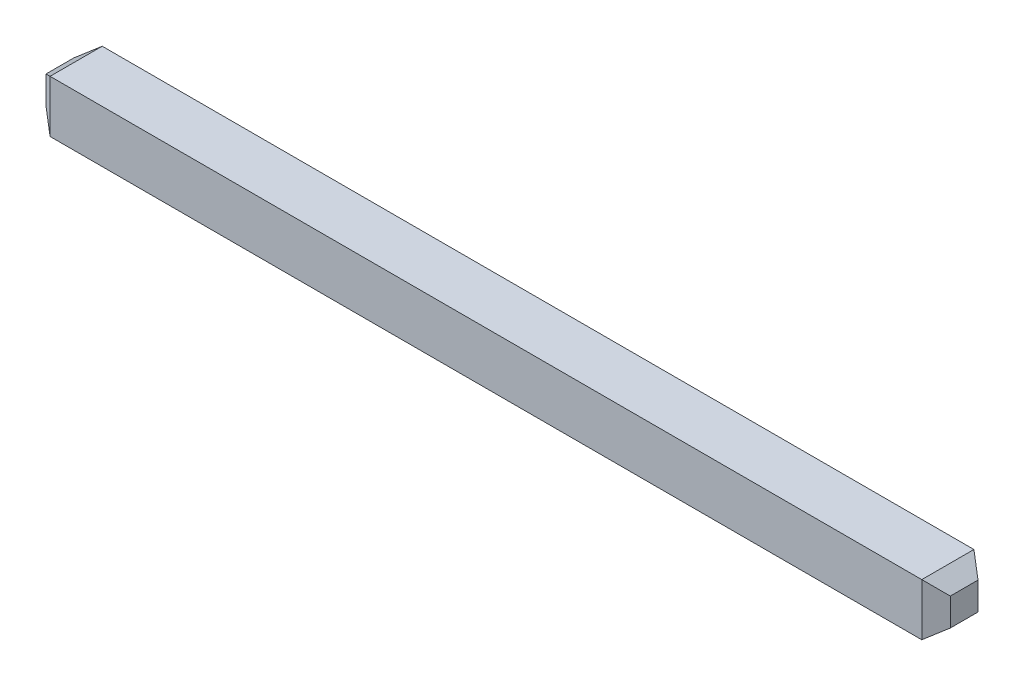
ISO-10303-21;
HEADER;
FILE_DESCRIPTION(('STEP AP214'),'2;1');
FILE_NAME('part.step','',(''),(''),'','','');
FILE_SCHEMA(('AUTOMOTIVE_DESIGN { 1 0 10303 214 1 1 1 1 }'));
ENDSEC;
DATA;
#1=APPLICATION_CONTEXT('core data for automotive mechanical design processes');
#2=APPLICATION_PROTOCOL_DEFINITION('international standard','automotive_design',2000,#1);
#3=PRODUCT_CONTEXT('',#1,'mechanical');
#4=PRODUCT('Part','Part','',(#3));
#5=PRODUCT_RELATED_PRODUCT_CATEGORY('part','',(#4));
#6=PRODUCT_DEFINITION_FORMATION('','',#4);
#7=PRODUCT_DEFINITION_CONTEXT('part definition',#1,'design');
#8=PRODUCT_DEFINITION('design','',#6,#7);
#9=PRODUCT_DEFINITION_SHAPE('','',#8);
#10=(LENGTH_UNIT() NAMED_UNIT(*) SI_UNIT(.MILLI.,.METRE.));
#11=(NAMED_UNIT(*) PLANE_ANGLE_UNIT() SI_UNIT($,.RADIAN.));
#12=(NAMED_UNIT(*) SI_UNIT($,.STERADIAN.) SOLID_ANGLE_UNIT());
#13=UNCERTAINTY_MEASURE_WITH_UNIT(LENGTH_MEASURE(1.E-05),#10,'distance_accuracy_value','');
#14=(GEOMETRIC_REPRESENTATION_CONTEXT(3) GLOBAL_UNCERTAINTY_ASSIGNED_CONTEXT((#13)) GLOBAL_UNIT_ASSIGNED_CONTEXT((#10,
#11,#12)) REPRESENTATION_CONTEXT('',''));
#15=CARTESIAN_POINT('',(0.,0.,0.));
#16=DIRECTION('',(0.,0.,1.));
#17=DIRECTION('',(1.,0.,0.));
#18=AXIS2_PLACEMENT_3D('',#15,#16,#17);
#19=CARTESIAN_POINT('',(-2.4,1.23,-16.755));
#20=DIRECTION('',(0.5999999999908,0.,0.8000000000069));
#21=DIRECTION('',(0.8000000000069,0.,-0.5999999999908));
#22=AXIS2_PLACEMENT_3D('',#19,#20,#21);
#23=PLANE('',#22);
#24=DIRECTION('',(0.,1.,0.));
#25=VECTOR('',#24,1.);
#26=CARTESIAN_POINT('',(-2.3,1.23,-16.83));
#27=LINE('',#26,#25);
#28=CARTESIAN_POINT('',(-2.29999999999957,1.55,-16.8299999999994));
#29=VERTEX_POINT('',#28);
#30=CARTESIAN_POINT('',(-2.29999999999958,0.909999999999898,-16.8299999999994));
#31=VERTEX_POINT('',#30);
#32=EDGE_CURVE('E101',#29,#31,#27,.F.);
#33=ORIENTED_EDGE('',*,*,#32,.T.);
#34=DIRECTION('',(-0.685994340569495,0.514495755428344,0.514495755427429));
#35=VECTOR('',#34,1.);
#36=CARTESIAN_POINT('',(-2.30000000000009,0.909999999999786,-16.83));
#37=LINE('',#36,#35);
#38=CARTESIAN_POINT('',(-2.50000000000021,1.06000000000001,-16.6800000000003));
#39=VERTEX_POINT('',#38);
#40=EDGE_CURVE('E85',#31,#39,#37,.T.);
#41=ORIENTED_EDGE('',*,*,#40,.T.);
#42=DIRECTION('',(0.,1.,0.));
#43=VECTOR('',#42,1.);
#44=CARTESIAN_POINT('',(-2.5,1.23,-16.68));
#45=LINE('',#44,#43);
#46=CARTESIAN_POINT('',(-2.50000000000043,1.4,-16.6800000000006));
#47=VERTEX_POINT('',#46);
#48=EDGE_CURVE('E79',#39,#47,#45,.T.);
#49=ORIENTED_EDGE('',*,*,#48,.T.);
#50=DIRECTION('',(-0.685994340570038,-0.514495755427529,0.51449575542752));
#51=VECTOR('',#50,1.);
#52=CARTESIAN_POINT('',(-2.3,1.55,-16.83));
#53=LINE('',#52,#51);
#54=EDGE_CURVE('E20',#29,#47,#53,.T.);
#55=ORIENTED_EDGE('',*,*,#54,.F.);
#56=EDGE_LOOP('',(#33,#41,#49,#55));
#57=FACE_BOUND('',#56,.T.);
#58=ADVANCED_FACE('F17',(#57),#23,.F.);
#59=CARTESIAN_POINT('',(8.5,1.23,-16.755));
#60=DIRECTION('',(-0.5999999999908,0.,0.8000000000069));
#61=DIRECTION('',(0.8000000000069,0.,0.5999999999908));
#62=AXIS2_PLACEMENT_3D('',#59,#60,#61);
#63=PLANE('',#62);
#64=DIRECTION('',(0.,1.,0.));
#65=VECTOR('',#64,1.);
#66=CARTESIAN_POINT('',(8.6,1.23,-16.68));
#67=LINE('',#66,#65);
#68=CARTESIAN_POINT('',(8.6000000000002,1.06000000000003,-16.6800000000003));
#69=VERTEX_POINT('',#68);
#70=CARTESIAN_POINT('',(8.60000000000043,1.4,-16.6800000000006));
#71=VERTEX_POINT('',#70);
#72=EDGE_CURVE('E113',#69,#71,#67,.T.);
#73=ORIENTED_EDGE('',*,*,#72,.F.);
#74=DIRECTION('',(-0.685994340569496,-0.514495755428343,-0.514495755427429));
#75=VECTOR('',#74,1.);
#76=CARTESIAN_POINT('',(8.59999999999996,1.06000000000005,-16.68));
#77=LINE('',#76,#75);
#78=CARTESIAN_POINT('',(8.39999999999959,0.909999999999884,-16.8299999999994));
#79=VERTEX_POINT('',#78);
#80=EDGE_CURVE('E108',#69,#79,#77,.T.);
#81=ORIENTED_EDGE('',*,*,#80,.T.);
#82=DIRECTION('',(0.,1.,0.));
#83=VECTOR('',#82,1.);
#84=CARTESIAN_POINT('',(8.4,1.23,-16.83));
#85=LINE('',#84,#83);
#86=CARTESIAN_POINT('',(8.39999999999957,1.55,-16.8299999999994));
#87=VERTEX_POINT('',#86);
#88=EDGE_CURVE('E99',#79,#87,#85,.T.);
#89=ORIENTED_EDGE('',*,*,#88,.T.);
#90=DIRECTION('',(-0.685994340570037,0.514495755427528,-0.514495755427522));
#91=VECTOR('',#90,1.);
#92=CARTESIAN_POINT('',(8.6,1.4,-16.68));
#93=LINE('',#92,#91);
#94=EDGE_CURVE('E116',#71,#87,#93,.T.);
#95=ORIENTED_EDGE('',*,*,#94,.F.);
#96=EDGE_LOOP('',(#73,#81,#89,#95));
#97=FACE_BOUND('',#96,.T.);
#98=ADVANCED_FACE('F214',(#97),#63,.F.);
#99=CARTESIAN_POINT('',(-2.4,1.475,-16.51));
#100=DIRECTION('',(-0.6,0.8,0.));
#101=DIRECTION('',(-0.8,-0.6,0.));
#102=AXIS2_PLACEMENT_3D('',#99,#100,#101);
#103=PLANE('',#102);
#104=DIRECTION('',(-0.685994340575992,-0.514495755427529,-0.514495755419582));
#105=VECTOR('',#104,1.);
#106=CARTESIAN_POINT('',(-2.29999999999913,1.55,-16.1900000000012));
#107=LINE('',#106,#105);
#108=CARTESIAN_POINT('',(-2.29999999999989,1.55,-16.1900000000001));
#109=VERTEX_POINT('',#108);
#110=CARTESIAN_POINT('',(-2.50000000000022,1.4,-16.3399999999997));
#111=VERTEX_POINT('',#110);
#112=EDGE_CURVE('E128',#109,#111,#107,.T.);
#113=ORIENTED_EDGE('',*,*,#112,.F.);
#114=DIRECTION('',(0.,0.,1.));
#115=VECTOR('',#114,1.);
#116=CARTESIAN_POINT('',(-2.3,1.55,-16.51));
#117=LINE('',#116,#115);
#118=EDGE_CURVE('E93',#29,#109,#117,.T.);
#119=ORIENTED_EDGE('',*,*,#118,.F.);
#120=ORIENTED_EDGE('',*,*,#54,.T.);
#121=DIRECTION('',(0.,0.,-1.));
#122=VECTOR('',#121,1.);
#123=CARTESIAN_POINT('',(-2.5,1.4,-16.51));
#124=LINE('',#123,#122);
#125=EDGE_CURVE('E87',#47,#111,#124,.F.);
#126=ORIENTED_EDGE('',*,*,#125,.T.);
#127=EDGE_LOOP('',(#113,#119,#120,#126));
#128=FACE_BOUND('',#127,.T.);
#129=ADVANCED_FACE('F90',(#128),#103,.T.);
#130=CARTESIAN_POINT('',(-2.5,1.23,-16.51));
#131=DIRECTION('',(1.,0.,0.));
#132=DIRECTION('',(0.,0.,-1.));
#133=AXIS2_PLACEMENT_3D('',#130,#131,#132);
#134=PLANE('',#133);
#135=DIRECTION('',(0.,1.,0.));
#136=VECTOR('',#135,1.);
#137=CARTESIAN_POINT('',(-2.50000000000087,1.23,-16.3399999999988));
#138=LINE('',#137,#136);
#139=CARTESIAN_POINT('',(-2.50000000000021,1.06000000000001,-16.3399999999997));
#140=VERTEX_POINT('',#139);
#141=EDGE_CURVE('E97',#111,#140,#138,.F.);
#142=ORIENTED_EDGE('',*,*,#141,.F.);
#143=ORIENTED_EDGE('',*,*,#125,.F.);
#144=ORIENTED_EDGE('',*,*,#48,.F.);
#145=DIRECTION('',(0.,0.,1.));
#146=VECTOR('',#145,1.);
#147=CARTESIAN_POINT('',(-2.49999999999996,1.06000000000005,-16.51));
#148=LINE('',#147,#146);
#149=EDGE_CURVE('E105',#39,#140,#148,.T.);
#150=ORIENTED_EDGE('',*,*,#149,.T.);
#151=EDGE_LOOP('',(#142,#143,#144,#150));
#152=FACE_BOUND('',#151,.T.);
#153=ADVANCED_FACE('F95',(#152),#134,.F.);
#154=CARTESIAN_POINT('',(3.05,1.23,-16.83));
#155=DIRECTION('',(0.,0.,1.));
#156=DIRECTION('',(1.,0.,0.));
#157=AXIS2_PLACEMENT_3D('',#154,#155,#156);
#158=PLANE('',#157);
#159=ORIENTED_EDGE('',*,*,#32,.F.);
#160=DIRECTION('',(1.,0.,0.));
#161=VECTOR('',#160,1.);
#162=CARTESIAN_POINT('',(3.05,1.55,-16.83));
#163=LINE('',#162,#161);
#164=EDGE_CURVE('E122',#87,#29,#163,.F.);
#165=ORIENTED_EDGE('',*,*,#164,.F.);
#166=ORIENTED_EDGE('',*,*,#88,.F.);
#167=DIRECTION('',(1.,0.,0.));
#168=VECTOR('',#167,1.);
#169=CARTESIAN_POINT('',(3.05,0.91,-16.83));
#170=LINE('',#169,#168);
#171=EDGE_CURVE('E136',#79,#31,#170,.F.);
#172=ORIENTED_EDGE('',*,*,#171,.T.);
#173=EDGE_LOOP('',(#159,#165,#166,#172));
#174=FACE_BOUND('',#173,.T.);
#175=ADVANCED_FACE('F182',(#174),#158,.F.);
#176=CARTESIAN_POINT('',(-2.4,0.9849999999999,-16.51));
#177=DIRECTION('',(0.600000000000912,0.799999999999316,0.));
#178=DIRECTION('',(-0.799999999999316,0.600000000000912,0.));
#179=AXIS2_PLACEMENT_3D('',#176,#177,#178);
#180=PLANE('',#179);
#181=DIRECTION('',(0.,0.,1.));
#182=VECTOR('',#181,1.);
#183=CARTESIAN_POINT('',(-2.3,0.91,-16.51));
#184=LINE('',#183,#182);
#185=CARTESIAN_POINT('',(-2.29999999999983,0.909999999999856,-16.1900000000003));
#186=VERTEX_POINT('',#185);
#187=EDGE_CURVE('E139',#31,#186,#184,.T.);
#188=ORIENTED_EDGE('',*,*,#187,.T.);
#189=DIRECTION('',(0.68599434057587,-0.514495755427782,0.514495755419491));
#190=VECTOR('',#189,1.);
#191=CARTESIAN_POINT('',(-2.50000000000087,1.06,-16.3399999999988));
#192=LINE('',#191,#190);
#193=EDGE_CURVE('E131',#140,#186,#192,.T.);
#194=ORIENTED_EDGE('',*,*,#193,.F.);
#195=ORIENTED_EDGE('',*,*,#149,.F.);
#196=ORIENTED_EDGE('',*,*,#40,.F.);
#197=EDGE_LOOP('',(#188,#194,#195,#196));
#198=FACE_BOUND('',#197,.T.);
#199=ADVANCED_FACE('F179',(#198),#180,.F.);
#200=CARTESIAN_POINT('',(8.5,0.9849999999999,-16.51));
#201=DIRECTION('',(-0.600000000000912,0.799999999999316,0.));
#202=DIRECTION('',(-0.799999999999316,-0.600000000000912,0.));
#203=AXIS2_PLACEMENT_3D('',#200,#201,#202);
#204=PLANE('',#203);
#205=DIRECTION('',(0.,0.,-1.));
#206=VECTOR('',#205,1.);
#207=CARTESIAN_POINT('',(8.6,1.06,-16.51));
#208=LINE('',#207,#206);
#209=CARTESIAN_POINT('',(8.6000000000002,1.06000000000003,-16.3399999999997));
#210=VERTEX_POINT('',#209);
#211=EDGE_CURVE('E110',#210,#69,#208,.T.);
#212=ORIENTED_EDGE('',*,*,#211,.F.);
#213=DIRECTION('',(0.685994340575871,0.514495755427787,-0.514495755419485));
#214=VECTOR('',#213,1.);
#215=CARTESIAN_POINT('',(8.39999999999913,0.9099999999999,-16.1900000000012));
#216=LINE('',#215,#214);
#217=CARTESIAN_POINT('',(8.39999999999993,0.909999999999868,-16.1900000000001));
#218=VERTEX_POINT('',#217);
#219=EDGE_CURVE('E35',#218,#210,#216,.T.);
#220=ORIENTED_EDGE('',*,*,#219,.F.);
#221=DIRECTION('',(0.,0.,1.));
#222=VECTOR('',#221,1.);
#223=CARTESIAN_POINT('',(8.4,0.91,-16.51));
#224=LINE('',#223,#222);
#225=EDGE_CURVE('E134',#218,#79,#224,.F.);
#226=ORIENTED_EDGE('',*,*,#225,.T.);
#227=ORIENTED_EDGE('',*,*,#80,.F.);
#228=EDGE_LOOP('',(#212,#220,#226,#227));
#229=FACE_BOUND('',#228,.T.);
#230=ADVANCED_FACE('F181',(#229),#204,.F.);
#231=CARTESIAN_POINT('',(8.6,1.23,-16.51));
#232=DIRECTION('',(1.,0.,0.));
#233=DIRECTION('',(0.,0.,-1.));
#234=AXIS2_PLACEMENT_3D('',#231,#232,#233);
#235=PLANE('',#234);
#236=ORIENTED_EDGE('',*,*,#72,.T.);
#237=DIRECTION('',(0.,0.,1.));
#238=VECTOR('',#237,1.);
#239=CARTESIAN_POINT('',(8.6,1.4,-16.51));
#240=LINE('',#239,#238);
#241=CARTESIAN_POINT('',(8.60000000000022,1.4,-16.3399999999997));
#242=VERTEX_POINT('',#241);
#243=EDGE_CURVE('E119',#242,#71,#240,.F.);
#244=ORIENTED_EDGE('',*,*,#243,.F.);
#245=DIRECTION('',(0.,1.,0.));
#246=VECTOR('',#245,1.);
#247=CARTESIAN_POINT('',(8.60000000000087,1.23,-16.3399999999988));
#248=LINE('',#247,#246);
#249=EDGE_CURVE('E142',#210,#242,#248,.T.);
#250=ORIENTED_EDGE('',*,*,#249,.F.);
#251=ORIENTED_EDGE('',*,*,#211,.T.);
#252=EDGE_LOOP('',(#236,#244,#250,#251));
#253=FACE_BOUND('',#252,.T.);
#254=ADVANCED_FACE('F189',(#253),#235,.T.);
#255=CARTESIAN_POINT('',(8.5,1.475,-16.51));
#256=DIRECTION('',(0.6,0.8,0.));
#257=DIRECTION('',(-0.8,0.6,0.));
#258=AXIS2_PLACEMENT_3D('',#255,#256,#257);
#259=PLANE('',#258);
#260=DIRECTION('',(-0.685994340575992,0.514495755427535,0.514495755419576));
#261=VECTOR('',#260,1.);
#262=CARTESIAN_POINT('',(8.60000000000087,1.4,-16.3399999999988));
#263=LINE('',#262,#261);
#264=CARTESIAN_POINT('',(8.39999999999989,1.55,-16.1900000000001));
#265=VERTEX_POINT('',#264);
#266=EDGE_CURVE('E145',#242,#265,#263,.T.);
#267=ORIENTED_EDGE('',*,*,#266,.F.);
#268=ORIENTED_EDGE('',*,*,#243,.T.);
#269=ORIENTED_EDGE('',*,*,#94,.T.);
#270=DIRECTION('',(0.,0.,1.));
#271=VECTOR('',#270,1.);
#272=CARTESIAN_POINT('',(8.4,1.55,-16.51));
#273=LINE('',#272,#271);
#274=EDGE_CURVE('E125',#265,#87,#273,.F.);
#275=ORIENTED_EDGE('',*,*,#274,.F.);
#276=EDGE_LOOP('',(#267,#268,#269,#275));
#277=FACE_BOUND('',#276,.T.);
#278=ADVANCED_FACE('F170',(#277),#259,.T.);
#279=CARTESIAN_POINT('',(3.05,1.55,-16.51));
#280=DIRECTION('',(0.,1.,0.));
#281=DIRECTION('',(0.,0.,1.));
#282=AXIS2_PLACEMENT_3D('',#279,#280,#281);
#283=PLANE('',#282);
#284=DIRECTION('',(1.,0.,0.));
#285=VECTOR('',#284,1.);
#286=CARTESIAN_POINT('',(3.05,1.55,-16.19));
#287=LINE('',#286,#285);
#288=EDGE_CURVE('E148',#265,#109,#287,.F.);
#289=ORIENTED_EDGE('',*,*,#288,.F.);
#290=ORIENTED_EDGE('',*,*,#274,.T.);
#291=ORIENTED_EDGE('',*,*,#164,.T.);
#292=ORIENTED_EDGE('',*,*,#118,.T.);
#293=EDGE_LOOP('',(#289,#290,#291,#292));
#294=FACE_BOUND('',#293,.T.);
#295=ADVANCED_FACE('F173',(#294),#283,.T.);
#296=CARTESIAN_POINT('',(-2.4,1.23,-16.265));
#297=DIRECTION('',(-0.599999999990736,0.,0.800000000006948));
#298=DIRECTION('',(0.800000000006948,0.,0.599999999990736));
#299=AXIS2_PLACEMENT_3D('',#296,#297,#298);
#300=PLANE('',#299);
#301=ORIENTED_EDGE('',*,*,#193,.T.);
#302=DIRECTION('',(0.,1.,0.));
#303=VECTOR('',#302,1.);
#304=CARTESIAN_POINT('',(-2.3,1.23,-16.19));
#305=LINE('',#304,#303);
#306=EDGE_CURVE('E151',#109,#186,#305,.F.);
#307=ORIENTED_EDGE('',*,*,#306,.F.);
#308=ORIENTED_EDGE('',*,*,#112,.T.);
#309=ORIENTED_EDGE('',*,*,#141,.T.);
#310=EDGE_LOOP('',(#301,#307,#308,#309));
#311=FACE_BOUND('',#310,.T.);
#312=ADVANCED_FACE('F176',(#311),#300,.T.);
#313=CARTESIAN_POINT('',(3.05,0.91,-16.51));
#314=DIRECTION('',(0.,1.,0.));
#315=DIRECTION('',(0.,0.,1.));
#316=AXIS2_PLACEMENT_3D('',#313,#314,#315);
#317=PLANE('',#316);
#318=ORIENTED_EDGE('',*,*,#187,.F.);
#319=ORIENTED_EDGE('',*,*,#171,.F.);
#320=ORIENTED_EDGE('',*,*,#225,.F.);
#321=DIRECTION('',(1.,0.,0.));
#322=VECTOR('',#321,1.);
#323=CARTESIAN_POINT('',(3.05,0.9099999999999,-16.19));
#324=LINE('',#323,#322);
#325=EDGE_CURVE('E26',#186,#218,#324,.T.);
#326=ORIENTED_EDGE('',*,*,#325,.F.);
#327=EDGE_LOOP('',(#318,#319,#320,#326));
#328=FACE_BOUND('',#327,.T.);
#329=ADVANCED_FACE('F162',(#328),#317,.F.);
#330=CARTESIAN_POINT('',(8.5,1.23,-16.265));
#331=DIRECTION('',(0.599999999990736,0.,0.800000000006948));
#332=DIRECTION('',(0.800000000006948,0.,-0.599999999990736));
#333=AXIS2_PLACEMENT_3D('',#330,#331,#332);
#334=PLANE('',#333);
#335=ORIENTED_EDGE('',*,*,#266,.T.);
#336=DIRECTION('',(0.,1.,0.));
#337=VECTOR('',#336,1.);
#338=CARTESIAN_POINT('',(8.4,1.23,-16.19));
#339=LINE('',#338,#337);
#340=EDGE_CURVE('E11',#218,#265,#339,.T.);
#341=ORIENTED_EDGE('',*,*,#340,.F.);
#342=ORIENTED_EDGE('',*,*,#219,.T.);
#343=ORIENTED_EDGE('',*,*,#249,.T.);
#344=EDGE_LOOP('',(#335,#341,#342,#343));
#345=FACE_BOUND('',#344,.T.);
#346=ADVANCED_FACE('F166',(#345),#334,.T.);
#347=CARTESIAN_POINT('',(3.05,1.23,-16.19));
#348=DIRECTION('',(0.,0.,1.));
#349=DIRECTION('',(1.,0.,0.));
#350=AXIS2_PLACEMENT_3D('',#347,#348,#349);
#351=PLANE('',#350);
#352=ORIENTED_EDGE('',*,*,#325,.T.);
#353=ORIENTED_EDGE('',*,*,#340,.T.);
#354=ORIENTED_EDGE('',*,*,#288,.T.);
#355=ORIENTED_EDGE('',*,*,#306,.T.);
#356=EDGE_LOOP('',(#352,#353,#354,#355));
#357=FACE_BOUND('',#356,.T.);
#358=ADVANCED_FACE('F157',(#357),#351,.T.);
#359=CLOSED_SHELL('',(#58,#98,#129,#153,#175,#199,#230,#254,#278,#295,#312,#329,#346,#358));
#360=MANIFOLD_SOLID_BREP('B1',#359);
#361=ADVANCED_BREP_SHAPE_REPRESENTATION('',(#18,#360),#14);
#362=SHAPE_DEFINITION_REPRESENTATION(#9,#361);
ENDSEC;
END-ISO-10303-21;
